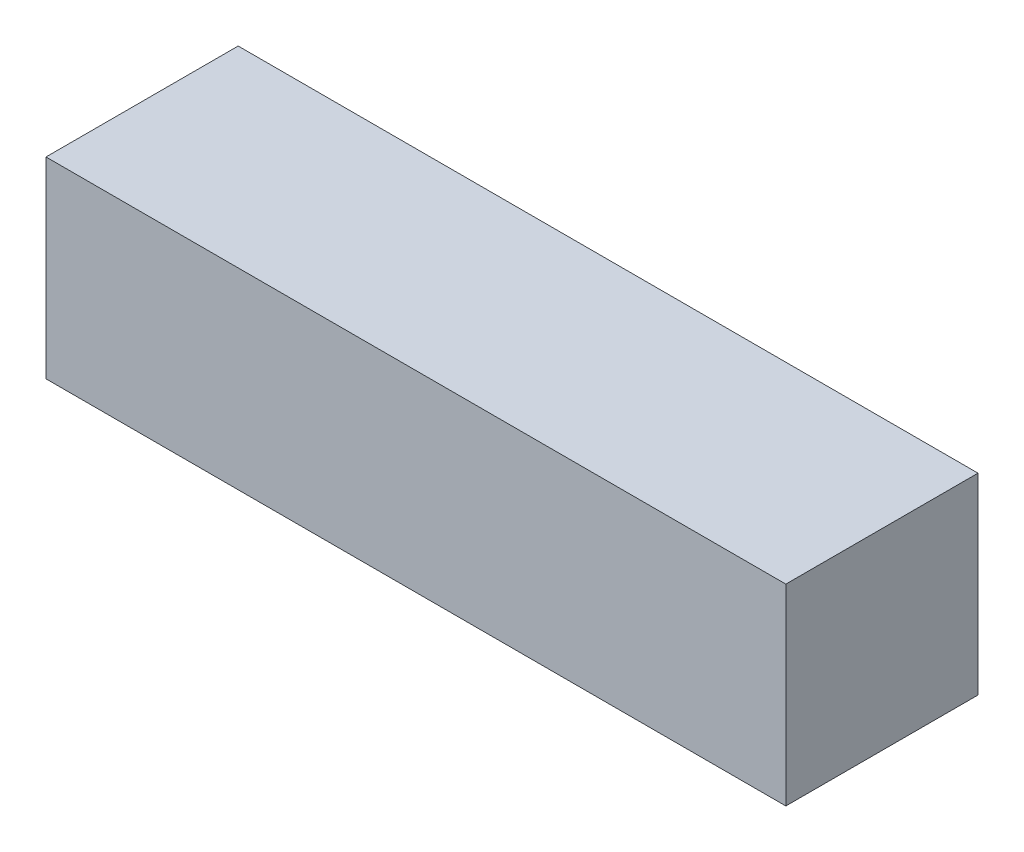
ISO-10303-21;
HEADER;
FILE_DESCRIPTION(('STEP AP214'),'2;1');
FILE_NAME('part.step','',(''),(''),'','','');
FILE_SCHEMA(('AUTOMOTIVE_DESIGN { 1 0 10303 214 1 1 1 1 }'));
ENDSEC;
DATA;
#1=APPLICATION_CONTEXT('core data for automotive mechanical design processes');
#2=APPLICATION_PROTOCOL_DEFINITION('international standard','automotive_design',2000,#1);
#3=PRODUCT_CONTEXT('',#1,'mechanical');
#4=PRODUCT('Part','Part','',(#3));
#5=PRODUCT_RELATED_PRODUCT_CATEGORY('part','',(#4));
#6=PRODUCT_DEFINITION_FORMATION('','',#4);
#7=PRODUCT_DEFINITION_CONTEXT('part definition',#1,'design');
#8=PRODUCT_DEFINITION('design','',#6,#7);
#9=PRODUCT_DEFINITION_SHAPE('','',#8);
#10=(LENGTH_UNIT() NAMED_UNIT(*) SI_UNIT(.MILLI.,.METRE.));
#11=(NAMED_UNIT(*) PLANE_ANGLE_UNIT() SI_UNIT($,.RADIAN.));
#12=(NAMED_UNIT(*) SI_UNIT($,.STERADIAN.) SOLID_ANGLE_UNIT());
#13=UNCERTAINTY_MEASURE_WITH_UNIT(LENGTH_MEASURE(1.E-05),#10,'distance_accuracy_value','');
#14=(GEOMETRIC_REPRESENTATION_CONTEXT(3) GLOBAL_UNCERTAINTY_ASSIGNED_CONTEXT((#13)) GLOBAL_UNIT_ASSIGNED_CONTEXT((#10,
#11,#12)) REPRESENTATION_CONTEXT('',''));
#15=CARTESIAN_POINT('',(0.,0.,0.));
#16=DIRECTION('',(0.,0.,1.));
#17=DIRECTION('',(1.,0.,0.));
#18=AXIS2_PLACEMENT_3D('',#15,#16,#17);
#19=CARTESIAN_POINT('',(0.385,0.25,0.));
#20=DIRECTION('',(0.,1.,0.));
#21=DIRECTION('',(-1.,0.,0.));
#22=AXIS2_PLACEMENT_3D('',#19,#20,#21);
#23=PLANE('',#22);
#24=DIRECTION('',(-1.,0.,0.));
#25=VECTOR('',#24,1.);
#26=CARTESIAN_POINT('',(0.385,0.25,0.));
#27=LINE('',#26,#25);
#28=CARTESIAN_POINT('',(0.385,0.25,0.));
#29=VERTEX_POINT('',#28);
#30=CARTESIAN_POINT('',(-0.385,0.25,0.));
#31=VERTEX_POINT('',#30);
#32=EDGE_CURVE('E11',#29,#31,#27,.T.);
#33=ORIENTED_EDGE('',*,*,#32,.T.);
#34=DIRECTION('',(0.,0.,1.));
#35=VECTOR('',#34,1.);
#36=CARTESIAN_POINT('',(-0.385,0.25,0.));
#37=LINE('',#36,#35);
#38=CARTESIAN_POINT('',(-0.385,0.25,0.2));
#39=VERTEX_POINT('',#38);
#40=EDGE_CURVE('E24',#31,#39,#37,.T.);
#41=ORIENTED_EDGE('',*,*,#40,.T.);
#42=DIRECTION('',(-1.,0.,0.));
#43=VECTOR('',#42,1.);
#44=CARTESIAN_POINT('',(0.385,0.25,0.2));
#45=LINE('',#44,#43);
#46=CARTESIAN_POINT('',(0.385,0.25,0.2));
#47=VERTEX_POINT('',#46);
#48=EDGE_CURVE('E75',#47,#39,#45,.T.);
#49=ORIENTED_EDGE('',*,*,#48,.F.);
#50=DIRECTION('',(0.,0.,1.));
#51=VECTOR('',#50,1.);
#52=CARTESIAN_POINT('',(0.385,0.25,0.));
#53=LINE('',#52,#51);
#54=EDGE_CURVE('E86',#29,#47,#53,.T.);
#55=ORIENTED_EDGE('',*,*,#54,.F.);
#56=EDGE_LOOP('',(#33,#41,#49,#55));
#57=FACE_BOUND('',#56,.T.);
#58=ADVANCED_FACE('F17',(#57),#23,.T.);
#59=CARTESIAN_POINT('',(0.385,0.05,0.));
#60=DIRECTION('',(1.,0.,0.));
#61=DIRECTION('',(0.,1.,0.));
#62=AXIS2_PLACEMENT_3D('',#59,#60,#61);
#63=PLANE('',#62);
#64=DIRECTION('',(0.,1.,0.));
#65=VECTOR('',#64,1.);
#66=CARTESIAN_POINT('',(0.385,0.05,0.));
#67=LINE('',#66,#65);
#68=CARTESIAN_POINT('',(0.385,0.05,0.));
#69=VERTEX_POINT('',#68);
#70=EDGE_CURVE('E83',#69,#29,#67,.T.);
#71=ORIENTED_EDGE('',*,*,#70,.T.);
#72=ORIENTED_EDGE('',*,*,#54,.T.);
#73=DIRECTION('',(0.,1.,0.));
#74=VECTOR('',#73,1.);
#75=CARTESIAN_POINT('',(0.385,0.05,0.2));
#76=LINE('',#75,#74);
#77=CARTESIAN_POINT('',(0.385,0.05,0.2));
#78=VERTEX_POINT('',#77);
#79=EDGE_CURVE('E81',#78,#47,#76,.T.);
#80=ORIENTED_EDGE('',*,*,#79,.F.);
#81=DIRECTION('',(0.,0.,1.));
#82=VECTOR('',#81,1.);
#83=CARTESIAN_POINT('',(0.385,0.05,0.));
#84=LINE('',#83,#82);
#85=EDGE_CURVE('E61',#69,#78,#84,.T.);
#86=ORIENTED_EDGE('',*,*,#85,.F.);
#87=EDGE_LOOP('',(#71,#72,#80,#86));
#88=FACE_BOUND('',#87,.T.);
#89=ADVANCED_FACE('F91',(#88),#63,.T.);
#90=CARTESIAN_POINT('',(-0.385,0.05,0.));
#91=DIRECTION('',(0.,-1.,0.));
#92=DIRECTION('',(1.,0.,0.));
#93=AXIS2_PLACEMENT_3D('',#90,#91,#92);
#94=PLANE('',#93);
#95=DIRECTION('',(1.,0.,0.));
#96=VECTOR('',#95,1.);
#97=CARTESIAN_POINT('',(-0.385,0.05,0.));
#98=LINE('',#97,#96);
#99=CARTESIAN_POINT('',(-0.385,0.05,0.));
#100=VERTEX_POINT('',#99);
#101=EDGE_CURVE('E65',#100,#69,#98,.T.);
#102=ORIENTED_EDGE('',*,*,#101,.T.);
#103=ORIENTED_EDGE('',*,*,#85,.T.);
#104=DIRECTION('',(1.,0.,0.));
#105=VECTOR('',#104,1.);
#106=CARTESIAN_POINT('',(-0.385,0.05,0.2));
#107=LINE('',#106,#105);
#108=CARTESIAN_POINT('',(-0.385,0.05,0.2));
#109=VERTEX_POINT('',#108);
#110=EDGE_CURVE('E54',#109,#78,#107,.T.);
#111=ORIENTED_EDGE('',*,*,#110,.F.);
#112=DIRECTION('',(0.,0.,1.));
#113=VECTOR('',#112,1.);
#114=CARTESIAN_POINT('',(-0.385,0.05,0.));
#115=LINE('',#114,#113);
#116=EDGE_CURVE('E58',#100,#109,#115,.T.);
#117=ORIENTED_EDGE('',*,*,#116,.F.);
#118=EDGE_LOOP('',(#102,#103,#111,#117));
#119=FACE_BOUND('',#118,.T.);
#120=ADVANCED_FACE('F57',(#119),#94,.T.);
#121=CARTESIAN_POINT('',(-0.385,0.25,0.));
#122=DIRECTION('',(-1.,0.,0.));
#123=DIRECTION('',(0.,-1.,0.));
#124=AXIS2_PLACEMENT_3D('',#121,#122,#123);
#125=PLANE('',#124);
#126=DIRECTION('',(0.,-1.,0.));
#127=VECTOR('',#126,1.);
#128=CARTESIAN_POINT('',(-0.385,0.25,0.));
#129=LINE('',#128,#127);
#130=EDGE_CURVE('E71',#31,#100,#129,.T.);
#131=ORIENTED_EDGE('',*,*,#130,.T.);
#132=ORIENTED_EDGE('',*,*,#116,.T.);
#133=DIRECTION('',(0.,-1.,0.));
#134=VECTOR('',#133,1.);
#135=CARTESIAN_POINT('',(-0.385,0.25,0.2));
#136=LINE('',#135,#134);
#137=EDGE_CURVE('E70',#39,#109,#136,.T.);
#138=ORIENTED_EDGE('',*,*,#137,.F.);
#139=ORIENTED_EDGE('',*,*,#40,.F.);
#140=EDGE_LOOP('',(#131,#132,#138,#139));
#141=FACE_BOUND('',#140,.T.);
#142=ADVANCED_FACE('F69',(#141),#125,.T.);
#143=CARTESIAN_POINT('',(0.,0.15,0.2));
#144=DIRECTION('',(0.,0.,1.));
#145=DIRECTION('',(1.,0.,0.));
#146=AXIS2_PLACEMENT_3D('',#143,#144,#145);
#147=PLANE('',#146);
#148=ORIENTED_EDGE('',*,*,#137,.T.);
#149=ORIENTED_EDGE('',*,*,#110,.T.);
#150=ORIENTED_EDGE('',*,*,#79,.T.);
#151=ORIENTED_EDGE('',*,*,#48,.T.);
#152=EDGE_LOOP('',(#148,#149,#150,#151));
#153=FACE_BOUND('',#152,.T.);
#154=ADVANCED_FACE('F74',(#153),#147,.T.);
#155=CARTESIAN_POINT('',(0.,0.15,0.));
#156=DIRECTION('',(0.,0.,1.));
#157=DIRECTION('',(1.,0.,0.));
#158=AXIS2_PLACEMENT_3D('',#155,#156,#157);
#159=PLANE('',#158);
#160=ORIENTED_EDGE('',*,*,#130,.F.);
#161=ORIENTED_EDGE('',*,*,#32,.F.);
#162=ORIENTED_EDGE('',*,*,#70,.F.);
#163=ORIENTED_EDGE('',*,*,#101,.F.);
#164=EDGE_LOOP('',(#160,#161,#162,#163));
#165=FACE_BOUND('',#164,.T.);
#166=ADVANCED_FACE('F89',(#165),#159,.F.);
#167=CLOSED_SHELL('',(#58,#89,#120,#142,#154,#166));
#168=MANIFOLD_SOLID_BREP('B1',#167);
#169=ADVANCED_BREP_SHAPE_REPRESENTATION('',(#18,#168),#14);
#170=SHAPE_DEFINITION_REPRESENTATION(#9,#169);
ENDSEC;
END-ISO-10303-21;
